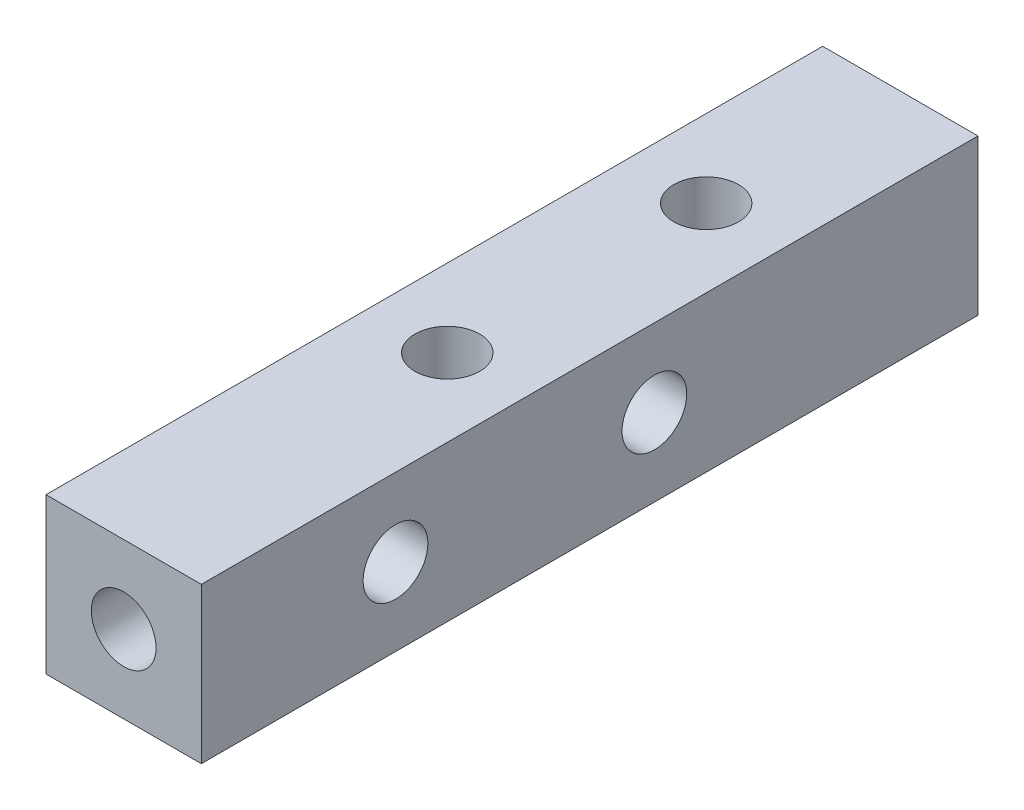
ISO-10303-21;
HEADER;
FILE_DESCRIPTION(('STEP AP214'),'2;1');
FILE_NAME('part.step','',(''),(''),'','','');
FILE_SCHEMA(('AUTOMOTIVE_DESIGN { 1 0 10303 214 1 1 1 1 }'));
ENDSEC;
DATA;
#1=APPLICATION_CONTEXT('core data for automotive mechanical design processes');
#2=APPLICATION_PROTOCOL_DEFINITION('international standard','automotive_design',2000,#1);
#3=PRODUCT_CONTEXT('',#1,'mechanical');
#4=PRODUCT('Part','Part','',(#3));
#5=PRODUCT_RELATED_PRODUCT_CATEGORY('part','',(#4));
#6=PRODUCT_DEFINITION_FORMATION('','',#4);
#7=PRODUCT_DEFINITION_CONTEXT('part definition',#1,'design');
#8=PRODUCT_DEFINITION('design','',#6,#7);
#9=PRODUCT_DEFINITION_SHAPE('','',#8);
#10=(LENGTH_UNIT() NAMED_UNIT(*) SI_UNIT(.MILLI.,.METRE.));
#11=(NAMED_UNIT(*) PLANE_ANGLE_UNIT() SI_UNIT($,.RADIAN.));
#12=(NAMED_UNIT(*) SI_UNIT($,.STERADIAN.) SOLID_ANGLE_UNIT());
#13=UNCERTAINTY_MEASURE_WITH_UNIT(LENGTH_MEASURE(1.E-05),#10,'distance_accuracy_value','');
#14=(GEOMETRIC_REPRESENTATION_CONTEXT(3) GLOBAL_UNCERTAINTY_ASSIGNED_CONTEXT((#13)) GLOBAL_UNIT_ASSIGNED_CONTEXT((#10,
#11,#12)) REPRESENTATION_CONTEXT('',''));
#15=CARTESIAN_POINT('',(0.,0.,0.));
#16=DIRECTION('',(0.,0.,1.));
#17=DIRECTION('',(1.,0.,0.));
#18=AXIS2_PLACEMENT_3D('',#15,#16,#17);
#19=CARTESIAN_POINT('',(3.,3.,0.));
#20=DIRECTION('',(0.,0.,1.));
#21=DIRECTION('',(1.,0.,0.));
#22=AXIS2_PLACEMENT_3D('',#19,#20,#21);
#23=CYLINDRICAL_SURFACE('',#22,1.24999999999999);
#24=CARTESIAN_POINT('',(3.,3.,0.));
#25=DIRECTION('',(0.,0.,1.));
#26=DIRECTION('',(1.,0.,0.));
#27=AXIS2_PLACEMENT_3D('',#24,#25,#26);
#28=CIRCLE('',#27,1.24999999999999);
#29=CARTESIAN_POINT('',(4.24999999999999,3.,0.));
#30=VERTEX_POINT('',#29);
#31=EDGE_CURVE('E184',#30,#30,#28,.T.);
#32=ORIENTED_EDGE('',*,*,#31,.T.);
#33=EDGE_LOOP('',(#32));
#34=FACE_BOUND('',#33,.T.);
#35=CARTESIAN_POINT('',(3.,3.,-7.5));
#36=DIRECTION('',(-0.707106781186547,0.,0.707106781186547));
#37=DIRECTION('',(0.707106781186547,0.,0.707106781186547));
#38=AXIS2_PLACEMENT_3D('',#35,#36,#37);
#39=ELLIPSE('',#38,1.76776695296636,1.24999999999999);
#40=CARTESIAN_POINT('',(3.,4.24999999999999,-7.5));
#41=VERTEX_POINT('',#40);
#42=CARTESIAN_POINT('',(3.,1.75000000000001,-7.5));
#43=VERTEX_POINT('',#42);
#44=EDGE_CURVE('E56',#41,#43,#39,.F.);
#45=ORIENTED_EDGE('',*,*,#44,.T.);
#46=CARTESIAN_POINT('',(3.,3.,-7.5));
#47=DIRECTION('',(0.707106781186547,0.,0.707106781186547));
#48=DIRECTION('',(-0.707106781186547,0.,0.707106781186547));
#49=AXIS2_PLACEMENT_3D('',#46,#47,#48);
#50=ELLIPSE('',#49,1.76776695296636,1.24999999999999);
#51=EDGE_CURVE('E11',#43,#41,#50,.F.);
#52=ORIENTED_EDGE('',*,*,#51,.T.);
#53=EDGE_LOOP('',(#45,#52));
#54=FACE_BOUND('',#53,.T.);
#55=ADVANCED_FACE('F43',(#34,#54),#23,.F.);
#56=CARTESIAN_POINT('',(3.,3.,-12.5));
#57=DIRECTION('',(0.,-0.707106781186547,0.707106781186547));
#58=DIRECTION('',(0.,0.707106781186547,0.707106781186547));
#59=AXIS2_PLACEMENT_3D('',#56,#57,#58);
#60=ELLIPSE('',#59,1.76776695296636,1.24999999999999);
#61=CARTESIAN_POINT('',(1.75000000000001,3.,-12.5));
#62=VERTEX_POINT('',#61);
#63=CARTESIAN_POINT('',(4.24999999999999,3.,-12.5));
#64=VERTEX_POINT('',#63);
#65=EDGE_CURVE('E135',#62,#64,#60,.T.);
#66=ORIENTED_EDGE('',*,*,#65,.T.);
#67=CARTESIAN_POINT('',(3.,3.,-12.5));
#68=DIRECTION('',(0.,0.707106781186547,0.707106781186547));
#69=DIRECTION('',(0.,-0.707106781186547,0.707106781186547));
#70=AXIS2_PLACEMENT_3D('',#67,#68,#69);
#71=ELLIPSE('',#70,1.76776695296636,1.24999999999999);
#72=EDGE_CURVE('E132',#64,#62,#71,.T.);
#73=ORIENTED_EDGE('',*,*,#72,.T.);
#74=EDGE_LOOP('',(#66,#73));
#75=FACE_BOUND('',#74,.T.);
#76=CARTESIAN_POINT('',(3.,3.,-17.5));
#77=DIRECTION('',(-0.707106781186547,0.,0.707106781186547));
#78=DIRECTION('',(0.707106781186547,0.,0.707106781186547));
#79=AXIS2_PLACEMENT_3D('',#76,#77,#78);
#80=ELLIPSE('',#79,1.76776695296636,1.24999999999999);
#81=CARTESIAN_POINT('',(3.,4.24999999999999,-17.5));
#82=VERTEX_POINT('',#81);
#83=CARTESIAN_POINT('',(3.,1.75000000000001,-17.5));
#84=VERTEX_POINT('',#83);
#85=EDGE_CURVE('E63',#82,#84,#80,.F.);
#86=ORIENTED_EDGE('',*,*,#85,.T.);
#87=CARTESIAN_POINT('',(3.,3.,-17.5));
#88=DIRECTION('',(0.707106781186547,0.,0.707106781186547));
#89=DIRECTION('',(-0.707106781186547,0.,0.707106781186547));
#90=AXIS2_PLACEMENT_3D('',#87,#88,#89);
#91=ELLIPSE('',#90,1.76776695296636,1.24999999999999);
#92=EDGE_CURVE('E116',#84,#82,#91,.F.);
#93=ORIENTED_EDGE('',*,*,#92,.T.);
#94=EDGE_LOOP('',(#86,#93));
#95=FACE_BOUND('',#94,.T.);
#96=ADVANCED_FACE('F253',(#75,#95),#23,.F.);
#97=CARTESIAN_POINT('',(3.,3.,-7.5));
#98=DIRECTION('',(-0.707106781186547,0.,0.707106781186547));
#99=DIRECTION('',(0.707106781186547,0.,0.707106781186547));
#100=AXIS2_PLACEMENT_3D('',#97,#98,#99);
#101=ELLIPSE('',#100,1.76776695296636,1.24999999999999);
#102=EDGE_CURVE('E109',#41,#43,#101,.T.);
#103=ORIENTED_EDGE('',*,*,#102,.T.);
#104=CARTESIAN_POINT('',(3.,3.,-7.5));
#105=DIRECTION('',(0.707106781186547,0.,0.707106781186547));
#106=DIRECTION('',(-0.707106781186547,0.,0.707106781186547));
#107=AXIS2_PLACEMENT_3D('',#104,#105,#106);
#108=ELLIPSE('',#107,1.76776695296636,1.24999999999999);
#109=EDGE_CURVE('E51',#43,#41,#108,.T.);
#110=ORIENTED_EDGE('',*,*,#109,.T.);
#111=EDGE_LOOP('',(#103,#110));
#112=FACE_BOUND('',#111,.T.);
#113=CARTESIAN_POINT('',(3.,3.,-12.5));
#114=DIRECTION('',(0.,-0.707106781186547,0.707106781186547));
#115=DIRECTION('',(0.,0.707106781186547,0.707106781186547));
#116=AXIS2_PLACEMENT_3D('',#113,#114,#115);
#117=ELLIPSE('',#116,1.76776695296636,1.24999999999999);
#118=EDGE_CURVE('E138',#62,#64,#117,.F.);
#119=ORIENTED_EDGE('',*,*,#118,.T.);
#120=CARTESIAN_POINT('',(3.,3.,-12.5));
#121=DIRECTION('',(0.,0.707106781186547,0.707106781186547));
#122=DIRECTION('',(0.,-0.707106781186547,0.707106781186547));
#123=AXIS2_PLACEMENT_3D('',#120,#121,#122);
#124=ELLIPSE('',#123,1.76776695296636,1.24999999999999);
#125=EDGE_CURVE('E129',#64,#62,#124,.F.);
#126=ORIENTED_EDGE('',*,*,#125,.T.);
#127=EDGE_LOOP('',(#119,#126));
#128=FACE_BOUND('',#127,.T.);
#129=ADVANCED_FACE('F118',(#112,#128),#23,.F.);
#130=CARTESIAN_POINT('',(3.,3.,-17.5));
#131=DIRECTION('',(-0.707106781186547,0.,0.707106781186547));
#132=DIRECTION('',(0.707106781186547,0.,0.707106781186547));
#133=AXIS2_PLACEMENT_3D('',#130,#131,#132);
#134=ELLIPSE('',#133,1.76776695296636,1.24999999999999);
#135=EDGE_CURVE('E125',#82,#84,#134,.T.);
#136=ORIENTED_EDGE('',*,*,#135,.T.);
#137=CARTESIAN_POINT('',(3.,3.,-17.5));
#138=DIRECTION('',(0.707106781186547,0.,0.707106781186547));
#139=DIRECTION('',(-0.707106781186547,0.,0.707106781186547));
#140=AXIS2_PLACEMENT_3D('',#137,#138,#139);
#141=ELLIPSE('',#140,1.76776695296636,1.24999999999999);
#142=EDGE_CURVE('E122',#84,#82,#141,.T.);
#143=ORIENTED_EDGE('',*,*,#142,.T.);
#144=EDGE_LOOP('',(#136,#143));
#145=FACE_BOUND('',#144,.T.);
#146=CARTESIAN_POINT('',(3.,3.,-22.5));
#147=DIRECTION('',(0.,-0.707106781186547,0.707106781186547));
#148=DIRECTION('',(0.,0.707106781186547,0.707106781186547));
#149=AXIS2_PLACEMENT_3D('',#146,#147,#148);
#150=ELLIPSE('',#149,1.76776695296636,1.24999999999999);
#151=CARTESIAN_POINT('',(1.75000000000001,3.,-22.5));
#152=VERTEX_POINT('',#151);
#153=CARTESIAN_POINT('',(4.24999999999999,3.,-22.5));
#154=VERTEX_POINT('',#153);
#155=EDGE_CURVE('E149',#152,#154,#150,.F.);
#156=ORIENTED_EDGE('',*,*,#155,.T.);
#157=CARTESIAN_POINT('',(3.,3.,-22.5));
#158=DIRECTION('',(0.,0.707106781186547,0.707106781186547));
#159=DIRECTION('',(0.,-0.707106781186547,0.707106781186547));
#160=AXIS2_PLACEMENT_3D('',#157,#158,#159);
#161=ELLIPSE('',#160,1.76776695296636,1.24999999999999);
#162=EDGE_CURVE('E140',#154,#152,#161,.F.);
#163=ORIENTED_EDGE('',*,*,#162,.T.);
#164=EDGE_LOOP('',(#156,#163));
#165=FACE_BOUND('',#164,.T.);
#166=ADVANCED_FACE('F249',(#145,#165),#23,.F.);
#167=CARTESIAN_POINT('',(6.,0.,0.));
#168=DIRECTION('',(0.,0.,-1.));
#169=DIRECTION('',(-1.,0.,0.));
#170=AXIS2_PLACEMENT_3D('',#167,#168,#169);
#171=PLANE('',#170);
#172=ORIENTED_EDGE('',*,*,#31,.F.);
#173=EDGE_LOOP('',(#172));
#174=FACE_BOUND('',#173,.T.);
#175=DIRECTION('',(0.,-1.,0.));
#176=VECTOR('',#175,1.);
#177=CARTESIAN_POINT('',(0.,0.,0.));
#178=LINE('',#177,#176);
#179=CARTESIAN_POINT('',(0.,6.,0.));
#180=VERTEX_POINT('',#179);
#181=CARTESIAN_POINT('',(0.,0.,0.));
#182=VERTEX_POINT('',#181);
#183=EDGE_CURVE('E171',#180,#182,#178,.T.);
#184=ORIENTED_EDGE('',*,*,#183,.T.);
#185=DIRECTION('',(-1.,0.,0.));
#186=VECTOR('',#185,1.);
#187=CARTESIAN_POINT('',(6.,0.,0.));
#188=LINE('',#187,#186);
#189=CARTESIAN_POINT('',(6.,0.,0.));
#190=VERTEX_POINT('',#189);
#191=EDGE_CURVE('E151',#190,#182,#188,.T.);
#192=ORIENTED_EDGE('',*,*,#191,.F.);
#193=DIRECTION('',(0.,-1.,0.));
#194=VECTOR('',#193,1.);
#195=CARTESIAN_POINT('',(6.,0.,0.));
#196=LINE('',#195,#194);
#197=CARTESIAN_POINT('',(6.,6.,0.));
#198=VERTEX_POINT('',#197);
#199=EDGE_CURVE('E166',#198,#190,#196,.T.);
#200=ORIENTED_EDGE('',*,*,#199,.F.);
#201=DIRECTION('',(-1.,0.,0.));
#202=VECTOR('',#201,1.);
#203=CARTESIAN_POINT('',(6.,6.,0.));
#204=LINE('',#203,#202);
#205=EDGE_CURVE('E160',#198,#180,#204,.T.);
#206=ORIENTED_EDGE('',*,*,#205,.T.);
#207=EDGE_LOOP('',(#184,#192,#200,#206));
#208=FACE_BOUND('',#207,.T.);
#209=ADVANCED_FACE('F45',(#174,#208),#171,.F.);
#210=CARTESIAN_POINT('',(6.,0.,0.));
#211=DIRECTION('',(0.,1.,0.));
#212=DIRECTION('',(0.,0.,1.));
#213=AXIS2_PLACEMENT_3D('',#210,#211,#212);
#214=PLANE('',#213);
#215=CARTESIAN_POINT('',(3.,0.,-12.5));
#216=DIRECTION('',(0.,1.,0.));
#217=DIRECTION('',(0.,0.,1.));
#218=AXIS2_PLACEMENT_3D('',#215,#216,#217);
#219=CIRCLE('',#218,1.25);
#220=CARTESIAN_POINT('',(3.,0.,-11.25));
#221=VERTEX_POINT('',#220);
#222=EDGE_CURVE('E193',#221,#221,#219,.T.);
#223=ORIENTED_EDGE('',*,*,#222,.T.);
#224=EDGE_LOOP('',(#223));
#225=FACE_BOUND('',#224,.T.);
#226=CARTESIAN_POINT('',(3.,0.,-22.5));
#227=DIRECTION('',(0.,1.,0.));
#228=DIRECTION('',(0.,0.,1.));
#229=AXIS2_PLACEMENT_3D('',#226,#227,#228);
#230=CIRCLE('',#229,1.25);
#231=CARTESIAN_POINT('',(3.,0.,-21.25));
#232=VERTEX_POINT('',#231);
#233=EDGE_CURVE('E187',#232,#232,#230,.T.);
#234=ORIENTED_EDGE('',*,*,#233,.T.);
#235=EDGE_LOOP('',(#234));
#236=FACE_BOUND('',#235,.T.);
#237=DIRECTION('',(0.,0.,-1.));
#238=VECTOR('',#237,1.);
#239=CARTESIAN_POINT('',(0.,0.,0.));
#240=LINE('',#239,#238);
#241=CARTESIAN_POINT('',(0.,0.,-30.));
#242=VERTEX_POINT('',#241);
#243=EDGE_CURVE('E169',#182,#242,#240,.T.);
#244=ORIENTED_EDGE('',*,*,#243,.T.);
#245=DIRECTION('',(-1.,0.,0.));
#246=VECTOR('',#245,1.);
#247=CARTESIAN_POINT('',(6.,0.,-30.));
#248=LINE('',#247,#246);
#249=CARTESIAN_POINT('',(6.,0.,-30.));
#250=VERTEX_POINT('',#249);
#251=EDGE_CURVE('E154',#250,#242,#248,.T.);
#252=ORIENTED_EDGE('',*,*,#251,.F.);
#253=DIRECTION('',(0.,0.,-1.));
#254=VECTOR('',#253,1.);
#255=CARTESIAN_POINT('',(6.,0.,0.));
#256=LINE('',#255,#254);
#257=EDGE_CURVE('E178',#190,#250,#256,.T.);
#258=ORIENTED_EDGE('',*,*,#257,.F.);
#259=ORIENTED_EDGE('',*,*,#191,.T.);
#260=EDGE_LOOP('',(#244,#252,#258,#259));
#261=FACE_BOUND('',#260,.T.);
#262=ADVANCED_FACE('F229',(#225,#236,#261),#214,.F.);
#263=CARTESIAN_POINT('',(6.,0.,-30.));
#264=DIRECTION('',(0.,0.,1.));
#265=DIRECTION('',(1.,0.,0.));
#266=AXIS2_PLACEMENT_3D('',#263,#264,#265);
#267=PLANE('',#266);
#268=CARTESIAN_POINT('',(3.,3.,-30.));
#269=DIRECTION('',(0.,0.,1.));
#270=DIRECTION('',(1.,0.,0.));
#271=AXIS2_PLACEMENT_3D('',#268,#269,#270);
#272=CIRCLE('',#271,1.24999999999999);
#273=CARTESIAN_POINT('',(4.24999999999999,3.,-30.));
#274=VERTEX_POINT('',#273);
#275=EDGE_CURVE('E174',#274,#274,#272,.T.);
#276=ORIENTED_EDGE('',*,*,#275,.T.);
#277=EDGE_LOOP('',(#276));
#278=FACE_BOUND('',#277,.T.);
#279=DIRECTION('',(0.,1.,0.));
#280=VECTOR('',#279,1.);
#281=CARTESIAN_POINT('',(0.,0.,-30.));
#282=LINE('',#281,#280);
#283=CARTESIAN_POINT('',(0.,6.,-30.));
#284=VERTEX_POINT('',#283);
#285=EDGE_CURVE('E167',#242,#284,#282,.T.);
#286=ORIENTED_EDGE('',*,*,#285,.T.);
#287=DIRECTION('',(-1.,0.,0.));
#288=VECTOR('',#287,1.);
#289=CARTESIAN_POINT('',(6.,6.,-30.));
#290=LINE('',#289,#288);
#291=CARTESIAN_POINT('',(6.,6.,-30.));
#292=VERTEX_POINT('',#291);
#293=EDGE_CURVE('E157',#292,#284,#290,.T.);
#294=ORIENTED_EDGE('',*,*,#293,.F.);
#295=DIRECTION('',(0.,1.,0.));
#296=VECTOR('',#295,1.);
#297=CARTESIAN_POINT('',(6.,0.,-30.));
#298=LINE('',#297,#296);
#299=EDGE_CURVE('E176',#250,#292,#298,.T.);
#300=ORIENTED_EDGE('',*,*,#299,.F.);
#301=ORIENTED_EDGE('',*,*,#251,.T.);
#302=EDGE_LOOP('',(#286,#294,#300,#301));
#303=FACE_BOUND('',#302,.T.);
#304=ADVANCED_FACE('F234',(#278,#303),#267,.F.);
#305=CARTESIAN_POINT('',(6.,6.,0.));
#306=DIRECTION('',(0.,-1.,0.));
#307=DIRECTION('',(0.,0.,-1.));
#308=AXIS2_PLACEMENT_3D('',#305,#306,#307);
#309=PLANE('',#308);
#310=CARTESIAN_POINT('',(3.,6.,-12.5));
#311=DIRECTION('',(0.,1.,0.));
#312=DIRECTION('',(0.,0.,1.));
#313=AXIS2_PLACEMENT_3D('',#310,#311,#312);
#314=CIRCLE('',#313,1.24999999999999);
#315=CARTESIAN_POINT('',(3.,6.,-11.25));
#316=VERTEX_POINT('',#315);
#317=EDGE_CURVE('E196',#316,#316,#314,.T.);
#318=ORIENTED_EDGE('',*,*,#317,.F.);
#319=EDGE_LOOP('',(#318));
#320=FACE_BOUND('',#319,.T.);
#321=CARTESIAN_POINT('',(3.,6.,-22.5));
#322=DIRECTION('',(0.,1.,0.));
#323=DIRECTION('',(0.,0.,1.));
#324=AXIS2_PLACEMENT_3D('',#321,#322,#323);
#325=CIRCLE('',#324,1.24999999999999);
#326=CARTESIAN_POINT('',(3.,6.,-21.25));
#327=VERTEX_POINT('',#326);
#328=EDGE_CURVE('E190',#327,#327,#325,.T.);
#329=ORIENTED_EDGE('',*,*,#328,.F.);
#330=EDGE_LOOP('',(#329));
#331=FACE_BOUND('',#330,.T.);
#332=DIRECTION('',(0.,0.,1.));
#333=VECTOR('',#332,1.);
#334=CARTESIAN_POINT('',(0.,6.,0.));
#335=LINE('',#334,#333);
#336=EDGE_CURVE('E164',#284,#180,#335,.T.);
#337=ORIENTED_EDGE('',*,*,#336,.T.);
#338=ORIENTED_EDGE('',*,*,#205,.F.);
#339=DIRECTION('',(0.,0.,1.));
#340=VECTOR('',#339,1.);
#341=CARTESIAN_POINT('',(6.,6.,0.));
#342=LINE('',#341,#340);
#343=EDGE_CURVE('E163',#292,#198,#342,.T.);
#344=ORIENTED_EDGE('',*,*,#343,.F.);
#345=ORIENTED_EDGE('',*,*,#293,.T.);
#346=EDGE_LOOP('',(#337,#338,#344,#345));
#347=FACE_BOUND('',#346,.T.);
#348=ADVANCED_FACE('F217',(#320,#331,#347),#309,.F.);
#349=CARTESIAN_POINT('',(6.,0.,0.));
#350=DIRECTION('',(-1.,0.,0.));
#351=DIRECTION('',(0.,0.,1.));
#352=AXIS2_PLACEMENT_3D('',#349,#350,#351);
#353=PLANE('',#352);
#354=CARTESIAN_POINT('',(6.,3.,-7.5));
#355=DIRECTION('',(1.,0.,0.));
#356=DIRECTION('',(0.,0.,-1.));
#357=AXIS2_PLACEMENT_3D('',#354,#355,#356);
#358=CIRCLE('',#357,1.24999999999999);
#359=CARTESIAN_POINT('',(6.,3.,-8.74999999999999));
#360=VERTEX_POINT('',#359);
#361=EDGE_CURVE('E208',#360,#360,#358,.T.);
#362=ORIENTED_EDGE('',*,*,#361,.F.);
#363=EDGE_LOOP('',(#362));
#364=FACE_BOUND('',#363,.T.);
#365=CARTESIAN_POINT('',(6.,3.,-17.5));
#366=DIRECTION('',(1.,0.,0.));
#367=DIRECTION('',(0.,0.,-1.));
#368=AXIS2_PLACEMENT_3D('',#365,#366,#367);
#369=CIRCLE('',#368,1.24999999999999);
#370=CARTESIAN_POINT('',(6.,3.,-18.75));
#371=VERTEX_POINT('',#370);
#372=EDGE_CURVE('E202',#371,#371,#369,.T.);
#373=ORIENTED_EDGE('',*,*,#372,.F.);
#374=EDGE_LOOP('',(#373));
#375=FACE_BOUND('',#374,.T.);
#376=ORIENTED_EDGE('',*,*,#199,.T.);
#377=ORIENTED_EDGE('',*,*,#257,.T.);
#378=ORIENTED_EDGE('',*,*,#299,.T.);
#379=ORIENTED_EDGE('',*,*,#343,.T.);
#380=EDGE_LOOP('',(#376,#377,#378,#379));
#381=FACE_BOUND('',#380,.T.);
#382=ADVANCED_FACE('F213',(#364,#375,#381),#353,.F.);
#383=CARTESIAN_POINT('',(0.,0.,0.));
#384=DIRECTION('',(-1.,0.,0.));
#385=DIRECTION('',(0.,0.,1.));
#386=AXIS2_PLACEMENT_3D('',#383,#384,#385);
#387=PLANE('',#386);
#388=CARTESIAN_POINT('',(0.,3.,-7.5));
#389=DIRECTION('',(1.,0.,0.));
#390=DIRECTION('',(0.,0.,-1.));
#391=AXIS2_PLACEMENT_3D('',#388,#389,#390);
#392=CIRCLE('',#391,1.25);
#393=CARTESIAN_POINT('',(0.,3.,-8.75));
#394=VERTEX_POINT('',#393);
#395=EDGE_CURVE('E205',#394,#394,#392,.T.);
#396=ORIENTED_EDGE('',*,*,#395,.T.);
#397=EDGE_LOOP('',(#396));
#398=FACE_BOUND('',#397,.T.);
#399=CARTESIAN_POINT('',(0.,3.,-17.5));
#400=DIRECTION('',(1.,0.,0.));
#401=DIRECTION('',(0.,0.,-1.));
#402=AXIS2_PLACEMENT_3D('',#399,#400,#401);
#403=CIRCLE('',#402,1.25);
#404=CARTESIAN_POINT('',(0.,3.,-18.75));
#405=VERTEX_POINT('',#404);
#406=EDGE_CURVE('E199',#405,#405,#403,.T.);
#407=ORIENTED_EDGE('',*,*,#406,.T.);
#408=EDGE_LOOP('',(#407));
#409=FACE_BOUND('',#408,.T.);
#410=ORIENTED_EDGE('',*,*,#183,.F.);
#411=ORIENTED_EDGE('',*,*,#336,.F.);
#412=ORIENTED_EDGE('',*,*,#285,.F.);
#413=ORIENTED_EDGE('',*,*,#243,.F.);
#414=EDGE_LOOP('',(#410,#411,#412,#413));
#415=FACE_BOUND('',#414,.T.);
#416=ADVANCED_FACE('F216',(#398,#409,#415),#387,.T.);
#417=CARTESIAN_POINT('',(3.,3.,-22.5));
#418=DIRECTION('',(0.,-0.707106781186547,0.707106781186547));
#419=DIRECTION('',(0.,0.707106781186547,0.707106781186547));
#420=AXIS2_PLACEMENT_3D('',#417,#418,#419);
#421=ELLIPSE('',#420,1.76776695296636,1.24999999999999);
#422=EDGE_CURVE('E146',#152,#154,#421,.T.);
#423=ORIENTED_EDGE('',*,*,#422,.T.);
#424=CARTESIAN_POINT('',(3.,3.,-22.5));
#425=DIRECTION('',(0.,0.707106781186547,0.707106781186547));
#426=DIRECTION('',(0.,-0.707106781186547,0.707106781186547));
#427=AXIS2_PLACEMENT_3D('',#424,#425,#426);
#428=ELLIPSE('',#427,1.76776695296636,1.24999999999999);
#429=EDGE_CURVE('E143',#154,#152,#428,.T.);
#430=ORIENTED_EDGE('',*,*,#429,.T.);
#431=EDGE_LOOP('',(#423,#430));
#432=FACE_BOUND('',#431,.T.);
#433=ORIENTED_EDGE('',*,*,#275,.F.);
#434=EDGE_LOOP('',(#433));
#435=FACE_BOUND('',#434,.T.);
#436=ADVANCED_FACE('F239',(#432,#435),#23,.F.);
#437=CARTESIAN_POINT('',(3.,6.,-22.5));
#438=DIRECTION('',(0.,1.,0.));
#439=DIRECTION('',(0.,0.,1.));
#440=AXIS2_PLACEMENT_3D('',#437,#438,#439);
#441=CYLINDRICAL_SURFACE('',#440,1.24999999999999);
#442=ORIENTED_EDGE('',*,*,#328,.T.);
#443=EDGE_LOOP('',(#442));
#444=FACE_BOUND('',#443,.T.);
#445=ORIENTED_EDGE('',*,*,#155,.F.);
#446=ORIENTED_EDGE('',*,*,#429,.F.);
#447=EDGE_LOOP('',(#445,#446));
#448=FACE_BOUND('',#447,.T.);
#449=ADVANCED_FACE('F246',(#444,#448),#441,.F.);
#450=ORIENTED_EDGE('',*,*,#233,.F.);
#451=EDGE_LOOP('',(#450));
#452=FACE_BOUND('',#451,.T.);
#453=ORIENTED_EDGE('',*,*,#422,.F.);
#454=ORIENTED_EDGE('',*,*,#162,.F.);
#455=EDGE_LOOP('',(#453,#454));
#456=FACE_BOUND('',#455,.T.);
#457=ADVANCED_FACE('F261',(#452,#456),#441,.F.);
#458=CARTESIAN_POINT('',(3.,6.,-12.5));
#459=DIRECTION('',(0.,1.,0.));
#460=DIRECTION('',(0.,0.,1.));
#461=AXIS2_PLACEMENT_3D('',#458,#459,#460);
#462=CYLINDRICAL_SURFACE('',#461,1.24999999999999);
#463=ORIENTED_EDGE('',*,*,#317,.T.);
#464=EDGE_LOOP('',(#463));
#465=FACE_BOUND('',#464,.T.);
#466=ORIENTED_EDGE('',*,*,#118,.F.);
#467=ORIENTED_EDGE('',*,*,#72,.F.);
#468=EDGE_LOOP('',(#466,#467));
#469=FACE_BOUND('',#468,.T.);
#470=ADVANCED_FACE('F264',(#465,#469),#462,.F.);
#471=ORIENTED_EDGE('',*,*,#222,.F.);
#472=EDGE_LOOP('',(#471));
#473=FACE_BOUND('',#472,.T.);
#474=ORIENTED_EDGE('',*,*,#65,.F.);
#475=ORIENTED_EDGE('',*,*,#125,.F.);
#476=EDGE_LOOP('',(#474,#475));
#477=FACE_BOUND('',#476,.T.);
#478=ADVANCED_FACE('F266',(#473,#477),#462,.F.);
#479=CARTESIAN_POINT('',(6.,3.,-17.5));
#480=DIRECTION('',(1.,0.,0.));
#481=DIRECTION('',(0.,0.,-1.));
#482=AXIS2_PLACEMENT_3D('',#479,#480,#481);
#483=CYLINDRICAL_SURFACE('',#482,1.24999999999999);
#484=ORIENTED_EDGE('',*,*,#372,.T.);
#485=EDGE_LOOP('',(#484));
#486=FACE_BOUND('',#485,.T.);
#487=ORIENTED_EDGE('',*,*,#85,.F.);
#488=ORIENTED_EDGE('',*,*,#142,.F.);
#489=EDGE_LOOP('',(#487,#488));
#490=FACE_BOUND('',#489,.T.);
#491=ADVANCED_FACE('F269',(#486,#490),#483,.F.);
#492=ORIENTED_EDGE('',*,*,#406,.F.);
#493=EDGE_LOOP('',(#492));
#494=FACE_BOUND('',#493,.T.);
#495=ORIENTED_EDGE('',*,*,#135,.F.);
#496=ORIENTED_EDGE('',*,*,#92,.F.);
#497=EDGE_LOOP('',(#495,#496));
#498=FACE_BOUND('',#497,.T.);
#499=ADVANCED_FACE('F271',(#494,#498),#483,.F.);
#500=CARTESIAN_POINT('',(6.,3.,-7.5));
#501=DIRECTION('',(1.,0.,0.));
#502=DIRECTION('',(0.,0.,-1.));
#503=AXIS2_PLACEMENT_3D('',#500,#501,#502);
#504=CYLINDRICAL_SURFACE('',#503,1.24999999999999);
#505=ORIENTED_EDGE('',*,*,#361,.T.);
#506=EDGE_LOOP('',(#505));
#507=FACE_BOUND('',#506,.T.);
#508=ORIENTED_EDGE('',*,*,#44,.F.);
#509=ORIENTED_EDGE('',*,*,#109,.F.);
#510=EDGE_LOOP('',(#508,#509));
#511=FACE_BOUND('',#510,.T.);
#512=ADVANCED_FACE('F115',(#507,#511),#504,.F.);
#513=ORIENTED_EDGE('',*,*,#395,.F.);
#514=EDGE_LOOP('',(#513));
#515=FACE_BOUND('',#514,.T.);
#516=ORIENTED_EDGE('',*,*,#102,.F.);
#517=ORIENTED_EDGE('',*,*,#51,.F.);
#518=EDGE_LOOP('',(#516,#517));
#519=FACE_BOUND('',#518,.T.);
#520=ADVANCED_FACE('F110',(#515,#519),#504,.F.);
#521=CLOSED_SHELL('',(#55,#96,#129,#166,#209,#262,#304,#348,#382,#416,#436,#449,#457,#470,#478,
#491,#499,#512,#520));
#522=MANIFOLD_SOLID_BREP('B2',#521);
#523=ADVANCED_BREP_SHAPE_REPRESENTATION('',(#18,#522),#14);
#524=SHAPE_DEFINITION_REPRESENTATION(#9,#523);
ENDSEC;
END-ISO-10303-21;
